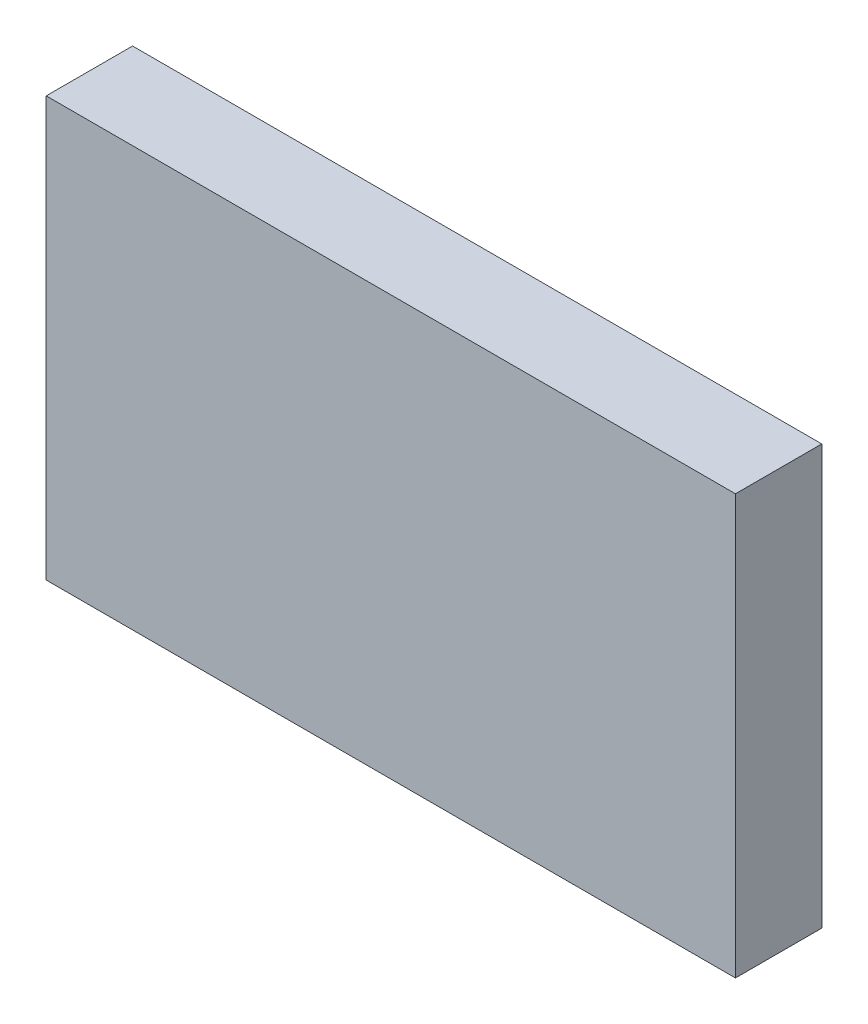
ISO-10303-21;
HEADER;
FILE_DESCRIPTION(('STEP AP214'),'2;1');
FILE_NAME('part.step','',(''),(''),'','','');
FILE_SCHEMA(('AUTOMOTIVE_DESIGN { 1 0 10303 214 1 1 1 1 }'));
ENDSEC;
DATA;
#1=APPLICATION_CONTEXT('core data for automotive mechanical design processes');
#2=APPLICATION_PROTOCOL_DEFINITION('international standard','automotive_design',2000,#1);
#3=PRODUCT_CONTEXT('',#1,'mechanical');
#4=PRODUCT('Part','Part','',(#3));
#5=PRODUCT_RELATED_PRODUCT_CATEGORY('part','',(#4));
#6=PRODUCT_DEFINITION_FORMATION('','',#4);
#7=PRODUCT_DEFINITION_CONTEXT('part definition',#1,'design');
#8=PRODUCT_DEFINITION('design','',#6,#7);
#9=PRODUCT_DEFINITION_SHAPE('','',#8);
#10=(LENGTH_UNIT() NAMED_UNIT(*) SI_UNIT(.MILLI.,.METRE.));
#11=(NAMED_UNIT(*) PLANE_ANGLE_UNIT() SI_UNIT($,.RADIAN.));
#12=(NAMED_UNIT(*) SI_UNIT($,.STERADIAN.) SOLID_ANGLE_UNIT());
#13=UNCERTAINTY_MEASURE_WITH_UNIT(LENGTH_MEASURE(1.E-05),#10,'distance_accuracy_value','');
#14=(GEOMETRIC_REPRESENTATION_CONTEXT(3) GLOBAL_UNCERTAINTY_ASSIGNED_CONTEXT((#13)) GLOBAL_UNIT_ASSIGNED_CONTEXT((#10,
#11,#12)) REPRESENTATION_CONTEXT('',''));
#15=CARTESIAN_POINT('',(0.,0.,0.));
#16=DIRECTION('',(0.,0.,1.));
#17=DIRECTION('',(1.,0.,0.));
#18=AXIS2_PLACEMENT_3D('',#15,#16,#17);
#19=CARTESIAN_POINT('',(-13.97,17.,1.75));
#20=DIRECTION('',(1.,0.,0.));
#21=DIRECTION('',(0.,0.,-1.));
#22=AXIS2_PLACEMENT_3D('',#19,#20,#21);
#23=PLANE('',#22);
#24=DIRECTION('',(0.,0.,1.));
#25=VECTOR('',#24,1.);
#26=CARTESIAN_POINT('',(-13.97,0.,1.75));
#27=LINE('',#26,#25);
#28=CARTESIAN_POINT('',(-13.97,0.,-1.75));
#29=VERTEX_POINT('',#28);
#30=CARTESIAN_POINT('',(-13.97,0.,1.75));
#31=VERTEX_POINT('',#30);
#32=EDGE_CURVE('E111',#29,#31,#27,.T.);
#33=ORIENTED_EDGE('',*,*,#32,.T.);
#34=DIRECTION('',(0.,-1.,0.));
#35=VECTOR('',#34,1.);
#36=CARTESIAN_POINT('',(-13.97,17.,1.75));
#37=LINE('',#36,#35);
#38=CARTESIAN_POINT('',(-13.97,17.,1.75));
#39=VERTEX_POINT('',#38);
#40=EDGE_CURVE('E11',#39,#31,#37,.T.);
#41=ORIENTED_EDGE('',*,*,#40,.F.);
#42=DIRECTION('',(0.,0.,1.));
#43=VECTOR('',#42,1.);
#44=CARTESIAN_POINT('',(-13.97,17.,1.75));
#45=LINE('',#44,#43);
#46=CARTESIAN_POINT('',(-13.97,17.,-1.75));
#47=VERTEX_POINT('',#46);
#48=EDGE_CURVE('E95',#47,#39,#45,.T.);
#49=ORIENTED_EDGE('',*,*,#48,.F.);
#50=DIRECTION('',(0.,-1.,0.));
#51=VECTOR('',#50,1.);
#52=CARTESIAN_POINT('',(-13.97,17.,-1.75));
#53=LINE('',#52,#51);
#54=EDGE_CURVE('E107',#47,#29,#53,.T.);
#55=ORIENTED_EDGE('',*,*,#54,.T.);
#56=EDGE_LOOP('',(#33,#41,#49,#55));
#57=FACE_BOUND('',#56,.T.);
#58=ADVANCED_FACE('F43',(#57),#23,.F.);
#59=CARTESIAN_POINT('',(13.97,17.,1.75));
#60=DIRECTION('',(0.,0.,-1.));
#61=DIRECTION('',(-1.,0.,0.));
#62=AXIS2_PLACEMENT_3D('',#59,#60,#61);
#63=PLANE('',#62);
#64=DIRECTION('',(1.,0.,0.));
#65=VECTOR('',#64,1.);
#66=CARTESIAN_POINT('',(13.97,0.,1.75));
#67=LINE('',#66,#65);
#68=CARTESIAN_POINT('',(13.97,0.,1.75));
#69=VERTEX_POINT('',#68);
#70=EDGE_CURVE('E100',#31,#69,#67,.T.);
#71=ORIENTED_EDGE('',*,*,#70,.T.);
#72=DIRECTION('',(0.,-1.,0.));
#73=VECTOR('',#72,1.);
#74=CARTESIAN_POINT('',(13.97,17.,1.75));
#75=LINE('',#74,#73);
#76=CARTESIAN_POINT('',(13.97,17.,1.75));
#77=VERTEX_POINT('',#76);
#78=EDGE_CURVE('E52',#77,#69,#75,.T.);
#79=ORIENTED_EDGE('',*,*,#78,.F.);
#80=DIRECTION('',(1.,0.,0.));
#81=VECTOR('',#80,1.);
#82=CARTESIAN_POINT('',(13.97,17.,1.75));
#83=LINE('',#82,#81);
#84=EDGE_CURVE('E90',#39,#77,#83,.T.);
#85=ORIENTED_EDGE('',*,*,#84,.F.);
#86=ORIENTED_EDGE('',*,*,#40,.T.);
#87=EDGE_LOOP('',(#71,#79,#85,#86));
#88=FACE_BOUND('',#87,.T.);
#89=ADVANCED_FACE('F99',(#88),#63,.F.);
#90=CARTESIAN_POINT('',(13.97,17.,1.75));
#91=DIRECTION('',(-1.,0.,0.));
#92=DIRECTION('',(0.,0.,1.));
#93=AXIS2_PLACEMENT_3D('',#90,#91,#92);
#94=PLANE('',#93);
#95=DIRECTION('',(0.,0.,-1.));
#96=VECTOR('',#95,1.);
#97=CARTESIAN_POINT('',(13.97,0.,1.75));
#98=LINE('',#97,#96);
#99=CARTESIAN_POINT('',(13.97,0.,-1.75));
#100=VERTEX_POINT('',#99);
#101=EDGE_CURVE('E77',#69,#100,#98,.T.);
#102=ORIENTED_EDGE('',*,*,#101,.T.);
#103=DIRECTION('',(0.,-1.,0.));
#104=VECTOR('',#103,1.);
#105=CARTESIAN_POINT('',(13.97,17.,-1.75));
#106=LINE('',#105,#104);
#107=CARTESIAN_POINT('',(13.97,17.,-1.75));
#108=VERTEX_POINT('',#107);
#109=EDGE_CURVE('E102',#108,#100,#106,.T.);
#110=ORIENTED_EDGE('',*,*,#109,.F.);
#111=DIRECTION('',(0.,0.,-1.));
#112=VECTOR('',#111,1.);
#113=CARTESIAN_POINT('',(13.97,17.,1.75));
#114=LINE('',#113,#112);
#115=EDGE_CURVE('E93',#77,#108,#114,.T.);
#116=ORIENTED_EDGE('',*,*,#115,.F.);
#117=ORIENTED_EDGE('',*,*,#78,.T.);
#118=EDGE_LOOP('',(#102,#110,#116,#117));
#119=FACE_BOUND('',#118,.T.);
#120=ADVANCED_FACE('F103',(#119),#94,.F.);
#121=CARTESIAN_POINT('',(13.97,17.,-1.75));
#122=DIRECTION('',(0.,0.,1.));
#123=DIRECTION('',(1.,0.,0.));
#124=AXIS2_PLACEMENT_3D('',#121,#122,#123);
#125=PLANE('',#124);
#126=DIRECTION('',(-1.,0.,0.));
#127=VECTOR('',#126,1.);
#128=CARTESIAN_POINT('',(13.97,0.,-1.75));
#129=LINE('',#128,#127);
#130=EDGE_CURVE('E83',#100,#29,#129,.T.);
#131=ORIENTED_EDGE('',*,*,#130,.T.);
#132=ORIENTED_EDGE('',*,*,#54,.F.);
#133=DIRECTION('',(-1.,0.,0.));
#134=VECTOR('',#133,1.);
#135=CARTESIAN_POINT('',(13.97,17.,-1.75));
#136=LINE('',#135,#134);
#137=EDGE_CURVE('E60',#108,#47,#136,.T.);
#138=ORIENTED_EDGE('',*,*,#137,.F.);
#139=ORIENTED_EDGE('',*,*,#109,.T.);
#140=EDGE_LOOP('',(#131,#132,#138,#139));
#141=FACE_BOUND('',#140,.T.);
#142=ADVANCED_FACE('F124',(#141),#125,.F.);
#143=CARTESIAN_POINT('',(0.,17.,0.));
#144=DIRECTION('',(0.,1.,0.));
#145=DIRECTION('',(0.,0.,1.));
#146=AXIS2_PLACEMENT_3D('',#143,#144,#145);
#147=PLANE('',#146);
#148=ORIENTED_EDGE('',*,*,#48,.T.);
#149=ORIENTED_EDGE('',*,*,#84,.T.);
#150=ORIENTED_EDGE('',*,*,#115,.T.);
#151=ORIENTED_EDGE('',*,*,#137,.T.);
#152=EDGE_LOOP('',(#148,#149,#150,#151));
#153=FACE_BOUND('',#152,.T.);
#154=ADVANCED_FACE('F91',(#153),#147,.T.);
#155=CARTESIAN_POINT('',(0.,0.,0.));
#156=DIRECTION('',(0.,1.,0.));
#157=DIRECTION('',(0.,0.,1.));
#158=AXIS2_PLACEMENT_3D('',#155,#156,#157);
#159=PLANE('',#158);
#160=ORIENTED_EDGE('',*,*,#32,.F.);
#161=ORIENTED_EDGE('',*,*,#130,.F.);
#162=ORIENTED_EDGE('',*,*,#101,.F.);
#163=ORIENTED_EDGE('',*,*,#70,.F.);
#164=EDGE_LOOP('',(#160,#161,#162,#163));
#165=FACE_BOUND('',#164,.T.);
#166=ADVANCED_FACE('F127',(#165),#159,.F.);
#167=CLOSED_SHELL('',(#58,#89,#120,#142,#154,#166));
#168=MANIFOLD_SOLID_BREP('B2',#167);
#169=ADVANCED_BREP_SHAPE_REPRESENTATION('',(#18,#168),#14);
#170=SHAPE_DEFINITION_REPRESENTATION(#9,#169);
ENDSEC;
END-ISO-10303-21;
